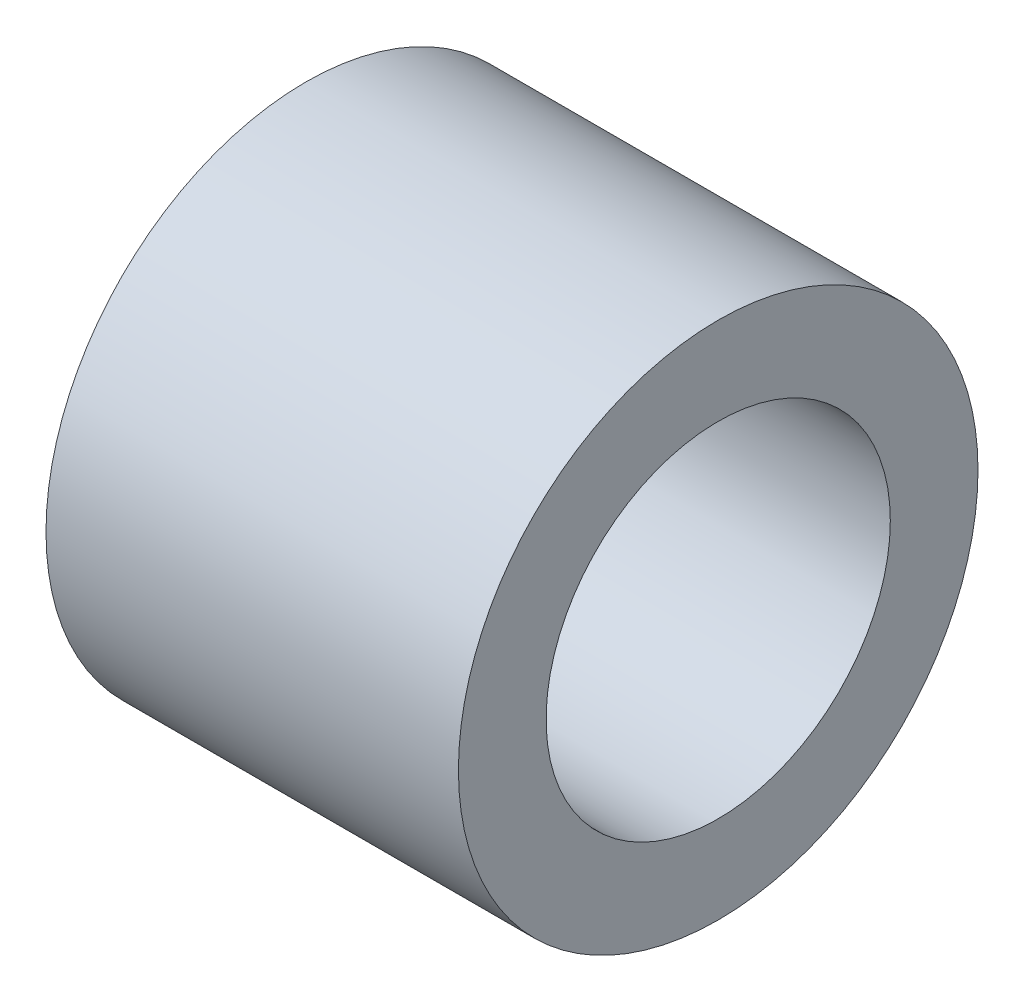
ISO-10303-21;
HEADER;
FILE_DESCRIPTION(('STEP AP214'),'2;1');
FILE_NAME('part.step','',(''),(''),'','','');
FILE_SCHEMA(('AUTOMOTIVE_DESIGN { 1 0 10303 214 1 1 1 1 }'));
ENDSEC;
DATA;
#1=APPLICATION_CONTEXT('core data for automotive mechanical design processes');
#2=APPLICATION_PROTOCOL_DEFINITION('international standard','automotive_design',2000,#1);
#3=PRODUCT_CONTEXT('',#1,'mechanical');
#4=PRODUCT('Part','Part','',(#3));
#5=PRODUCT_RELATED_PRODUCT_CATEGORY('part','',(#4));
#6=PRODUCT_DEFINITION_FORMATION('','',#4);
#7=PRODUCT_DEFINITION_CONTEXT('part definition',#1,'design');
#8=PRODUCT_DEFINITION('design','',#6,#7);
#9=PRODUCT_DEFINITION_SHAPE('','',#8);
#10=(LENGTH_UNIT() NAMED_UNIT(*) SI_UNIT(.MILLI.,.METRE.));
#11=(NAMED_UNIT(*) PLANE_ANGLE_UNIT() SI_UNIT($,.RADIAN.));
#12=(NAMED_UNIT(*) SI_UNIT($,.STERADIAN.) SOLID_ANGLE_UNIT());
#13=UNCERTAINTY_MEASURE_WITH_UNIT(LENGTH_MEASURE(1.E-05),#10,'distance_accuracy_value','');
#14=(GEOMETRIC_REPRESENTATION_CONTEXT(3) GLOBAL_UNCERTAINTY_ASSIGNED_CONTEXT((#13)) GLOBAL_UNIT_ASSIGNED_CONTEXT((#10,
#11,#12)) REPRESENTATION_CONTEXT('',''));
#15=CARTESIAN_POINT('',(0.,0.,0.));
#16=DIRECTION('',(0.,0.,1.));
#17=DIRECTION('',(1.,0.,0.));
#18=AXIS2_PLACEMENT_3D('',#15,#16,#17);
#19=CARTESIAN_POINT('',(6.35,0.,0.));
#20=DIRECTION('',(1.,0.,0.));
#21=DIRECTION('',(0.,0.,-1.));
#22=AXIS2_PLACEMENT_3D('',#19,#20,#21);
#23=PLANE('',#22);
#24=CARTESIAN_POINT('',(6.35,0.,0.));
#25=DIRECTION('',(1.,0.,0.));
#26=DIRECTION('',(0.,0.,-1.));
#27=AXIS2_PLACEMENT_3D('',#24,#25,#26);
#28=CIRCLE('',#27,4.);
#29=CARTESIAN_POINT('',(6.35,0.,-4.));
#30=VERTEX_POINT('',#29);
#31=EDGE_CURVE('E10',#30,#30,#28,.T.);
#32=ORIENTED_EDGE('',*,*,#31,.T.);
#33=EDGE_LOOP('',(#32));
#34=FACE_BOUND('',#33,.T.);
#35=CARTESIAN_POINT('',(6.35,0.,0.));
#36=DIRECTION('',(1.,0.,0.));
#37=DIRECTION('',(0.,0.,-1.));
#38=AXIS2_PLACEMENT_3D('',#35,#36,#37);
#39=CIRCLE('',#38,2.65);
#40=CARTESIAN_POINT('',(6.35,0.,-2.65));
#41=VERTEX_POINT('',#40);
#42=EDGE_CURVE('E42',#41,#41,#39,.T.);
#43=ORIENTED_EDGE('',*,*,#42,.F.);
#44=EDGE_LOOP('',(#43));
#45=FACE_BOUND('',#44,.T.);
#46=ADVANCED_FACE('F31',(#34,#45),#23,.T.);
#47=CARTESIAN_POINT('',(0.,0.,0.));
#48=DIRECTION('',(1.,0.,0.));
#49=DIRECTION('',(0.,0.,-1.));
#50=AXIS2_PLACEMENT_3D('',#47,#48,#49);
#51=PLANE('',#50);
#52=CARTESIAN_POINT('',(0.,0.,0.));
#53=DIRECTION('',(1.,0.,0.));
#54=DIRECTION('',(0.,0.,-1.));
#55=AXIS2_PLACEMENT_3D('',#52,#53,#54);
#56=CIRCLE('',#55,4.);
#57=CARTESIAN_POINT('',(0.,0.,-4.));
#58=VERTEX_POINT('',#57);
#59=EDGE_CURVE('E35',#58,#58,#56,.T.);
#60=ORIENTED_EDGE('',*,*,#59,.F.);
#61=EDGE_LOOP('',(#60));
#62=FACE_BOUND('',#61,.T.);
#63=CARTESIAN_POINT('',(0.,0.,0.));
#64=DIRECTION('',(1.,0.,0.));
#65=DIRECTION('',(0.,0.,-1.));
#66=AXIS2_PLACEMENT_3D('',#63,#64,#65);
#67=CIRCLE('',#66,2.65);
#68=CARTESIAN_POINT('',(0.,0.,-2.65));
#69=VERTEX_POINT('',#68);
#70=EDGE_CURVE('E44',#69,#69,#67,.T.);
#71=ORIENTED_EDGE('',*,*,#70,.T.);
#72=EDGE_LOOP('',(#71));
#73=FACE_BOUND('',#72,.T.);
#74=ADVANCED_FACE('F54',(#62,#73),#51,.F.);
#75=CARTESIAN_POINT('',(6.35,0.,0.));
#76=DIRECTION('',(-1.,0.,0.));
#77=DIRECTION('',(0.,0.,1.));
#78=AXIS2_PLACEMENT_3D('',#75,#76,#77);
#79=CYLINDRICAL_SURFACE('',#78,4.);
#80=ORIENTED_EDGE('',*,*,#31,.F.);
#81=EDGE_LOOP('',(#80));
#82=FACE_BOUND('',#81,.T.);
#83=ORIENTED_EDGE('',*,*,#59,.T.);
#84=EDGE_LOOP('',(#83));
#85=FACE_BOUND('',#84,.T.);
#86=ADVANCED_FACE('F33',(#82,#85),#79,.T.);
#87=CARTESIAN_POINT('',(6.35,0.,0.));
#88=DIRECTION('',(-1.,0.,0.));
#89=DIRECTION('',(0.,0.,1.));
#90=AXIS2_PLACEMENT_3D('',#87,#88,#89);
#91=CYLINDRICAL_SURFACE('',#90,2.65);
#92=ORIENTED_EDGE('',*,*,#42,.T.);
#93=EDGE_LOOP('',(#92));
#94=FACE_BOUND('',#93,.T.);
#95=ORIENTED_EDGE('',*,*,#70,.F.);
#96=EDGE_LOOP('',(#95));
#97=FACE_BOUND('',#96,.T.);
#98=ADVANCED_FACE('F50',(#94,#97),#91,.F.);
#99=CLOSED_SHELL('',(#46,#74,#86,#98));
#100=MANIFOLD_SOLID_BREP('B2',#99);
#101=ADVANCED_BREP_SHAPE_REPRESENTATION('',(#18,#100),#14);
#102=SHAPE_DEFINITION_REPRESENTATION(#9,#101);
ENDSEC;
END-ISO-10303-21;
